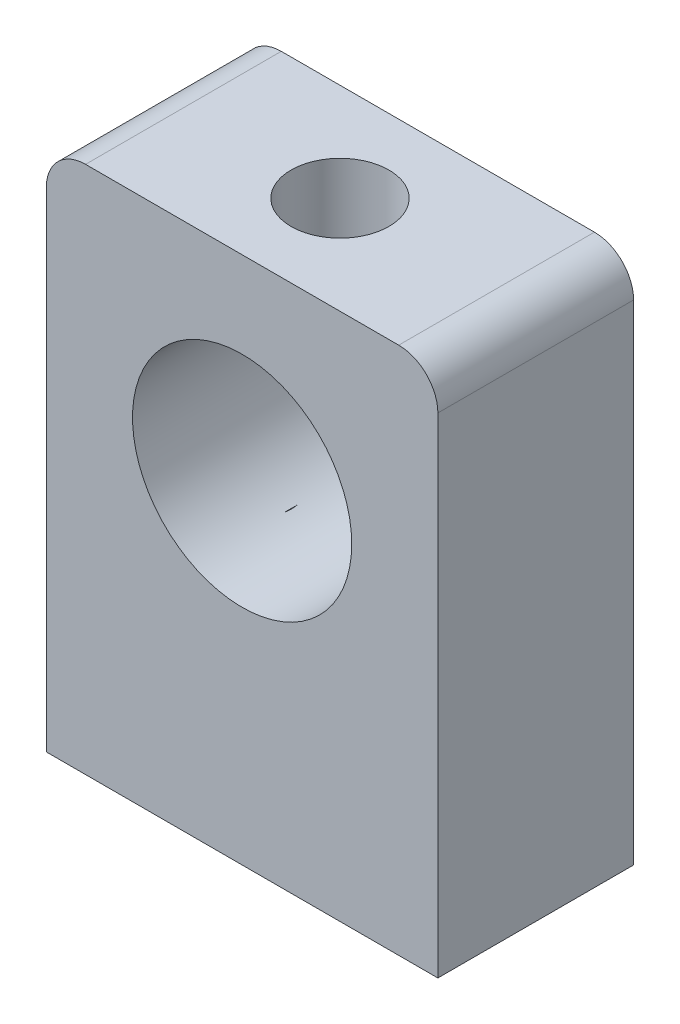
ISO-10303-21;
HEADER;
FILE_DESCRIPTION(('STEP AP214'),'2;1');
FILE_NAME('part.step','',(''),(''),'','','');
FILE_SCHEMA(('AUTOMOTIVE_DESIGN { 1 0 10303 214 1 1 1 1 }'));
ENDSEC;
DATA;
#1=APPLICATION_CONTEXT('core data for automotive mechanical design processes');
#2=APPLICATION_PROTOCOL_DEFINITION('international standard','automotive_design',2000,#1);
#3=PRODUCT_CONTEXT('',#1,'mechanical');
#4=PRODUCT('Part','Part','',(#3));
#5=PRODUCT_RELATED_PRODUCT_CATEGORY('part','',(#4));
#6=PRODUCT_DEFINITION_FORMATION('','',#4);
#7=PRODUCT_DEFINITION_CONTEXT('part definition',#1,'design');
#8=PRODUCT_DEFINITION('design','',#6,#7);
#9=PRODUCT_DEFINITION_SHAPE('','',#8);
#10=(LENGTH_UNIT() NAMED_UNIT(*) SI_UNIT(.MILLI.,.METRE.));
#11=(NAMED_UNIT(*) PLANE_ANGLE_UNIT() SI_UNIT($,.RADIAN.));
#12=(NAMED_UNIT(*) SI_UNIT($,.STERADIAN.) SOLID_ANGLE_UNIT());
#13=UNCERTAINTY_MEASURE_WITH_UNIT(LENGTH_MEASURE(1.E-05),#10,'distance_accuracy_value','');
#14=(GEOMETRIC_REPRESENTATION_CONTEXT(3) GLOBAL_UNCERTAINTY_ASSIGNED_CONTEXT((#13)) GLOBAL_UNIT_ASSIGNED_CONTEXT((#10,
#11,#12)) REPRESENTATION_CONTEXT('',''));
#15=CARTESIAN_POINT('',(0.,0.,0.));
#16=DIRECTION('',(0.,0.,1.));
#17=DIRECTION('',(1.,0.,0.));
#18=AXIS2_PLACEMENT_3D('',#15,#16,#17);
#19=CARTESIAN_POINT('',(-9.06164383561643,7.77739726027397,10.));
#20=DIRECTION('',(0.,0.,1.));
#21=DIRECTION('',(1.,0.,0.));
#22=AXIS2_PLACEMENT_3D('',#19,#20,#21);
#23=PLANE('',#22);
#24=DIRECTION('',(0.,1.,0.));
#25=VECTOR('',#24,1.);
#26=CARTESIAN_POINT('',(8.93835616438356,7.77739726027396,10.));
#27=LINE('',#26,#25);
#28=CARTESIAN_POINT('',(8.93835616438357,-17.222602739726,10.));
#29=VERTEX_POINT('',#28);
#30=CARTESIAN_POINT('',(8.93835616438356,7.77739726027396,10.));
#31=VERTEX_POINT('',#30);
#32=EDGE_CURVE('E173',#29,#31,#27,.T.);
#33=ORIENTED_EDGE('',*,*,#32,.T.);
#34=CARTESIAN_POINT('',(6.93835616438356,7.77739726027397,10.));
#35=DIRECTION('',(0.,0.,1.));
#36=DIRECTION('',(-1.,0.,0.));
#37=AXIS2_PLACEMENT_3D('',#34,#35,#36);
#38=CIRCLE('',#37,2.);
#39=CARTESIAN_POINT('',(6.93835616438355,9.77739726027397,10.));
#40=VERTEX_POINT('',#39);
#41=EDGE_CURVE('E193',#31,#40,#38,.T.);
#42=ORIENTED_EDGE('',*,*,#41,.T.);
#43=DIRECTION('',(-1.,0.,0.));
#44=VECTOR('',#43,1.);
#45=CARTESIAN_POINT('',(-9.06164383561642,9.77739726027397,10.));
#46=LINE('',#45,#44);
#47=CARTESIAN_POINT('',(-9.06164383561642,9.77739726027397,10.));
#48=VERTEX_POINT('',#47);
#49=EDGE_CURVE('E191',#40,#48,#46,.T.);
#50=ORIENTED_EDGE('',*,*,#49,.T.);
#51=CARTESIAN_POINT('',(-9.06164383561643,7.77739726027397,10.));
#52=DIRECTION('',(0.,0.,1.));
#53=DIRECTION('',(1.,0.,0.));
#54=AXIS2_PLACEMENT_3D('',#51,#52,#53);
#55=CIRCLE('',#54,2.);
#56=CARTESIAN_POINT('',(-11.0616438356164,7.77739726027396,10.));
#57=VERTEX_POINT('',#56);
#58=EDGE_CURVE('E189',#48,#57,#55,.T.);
#59=ORIENTED_EDGE('',*,*,#58,.T.);
#60=DIRECTION('',(0.,-1.,0.));
#61=VECTOR('',#60,1.);
#62=CARTESIAN_POINT('',(-11.0616438356164,7.77739726027396,10.));
#63=LINE('',#62,#61);
#64=CARTESIAN_POINT('',(-11.0616438356164,-17.222602739726,10.));
#65=VERTEX_POINT('',#64);
#66=EDGE_CURVE('E187',#57,#65,#63,.T.);
#67=ORIENTED_EDGE('',*,*,#66,.T.);
#68=DIRECTION('',(1.,0.,0.));
#69=VECTOR('',#68,1.);
#70=CARTESIAN_POINT('',(-11.0616438356164,-17.222602739726,10.));
#71=LINE('',#70,#69);
#72=EDGE_CURVE('E170',#65,#29,#71,.T.);
#73=ORIENTED_EDGE('',*,*,#72,.T.);
#74=EDGE_LOOP('',(#33,#42,#50,#59,#67,#73));
#75=FACE_BOUND('',#74,.T.);
#76=CARTESIAN_POINT('',(-1.06164383561643,-0.222602739726027,10.));
#77=DIRECTION('',(0.,0.,1.));
#78=DIRECTION('',(1.,0.,0.));
#79=AXIS2_PLACEMENT_3D('',#76,#77,#78);
#80=CIRCLE('',#79,5.6);
#81=CARTESIAN_POINT('',(4.53835616438357,-0.222602739726027,10.));
#82=VERTEX_POINT('',#81);
#83=EDGE_CURVE('E185',#82,#82,#80,.T.);
#84=ORIENTED_EDGE('',*,*,#83,.F.);
#85=EDGE_LOOP('',(#84));
#86=FACE_BOUND('',#85,.T.);
#87=ADVANCED_FACE('F41',(#75,#86),#23,.T.);
#88=CARTESIAN_POINT('',(-9.06164383561643,7.77739726027397,0.));
#89=DIRECTION('',(0.,0.,1.));
#90=DIRECTION('',(1.,0.,0.));
#91=AXIS2_PLACEMENT_3D('',#88,#89,#90);
#92=PLANE('',#91);
#93=DIRECTION('',(0.,1.,0.));
#94=VECTOR('',#93,1.);
#95=CARTESIAN_POINT('',(8.93835616438356,7.77739726027396,0.));
#96=LINE('',#95,#94);
#97=CARTESIAN_POINT('',(8.93835616438357,-17.222602739726,0.));
#98=VERTEX_POINT('',#97);
#99=CARTESIAN_POINT('',(8.93835616438356,7.77739726027396,0.));
#100=VERTEX_POINT('',#99);
#101=EDGE_CURVE('E182',#98,#100,#96,.T.);
#102=ORIENTED_EDGE('',*,*,#101,.F.);
#103=DIRECTION('',(1.,0.,0.));
#104=VECTOR('',#103,1.);
#105=CARTESIAN_POINT('',(-11.0616438356164,-17.222602739726,0.));
#106=LINE('',#105,#104);
#107=CARTESIAN_POINT('',(-11.0616438356164,-17.222602739726,0.));
#108=VERTEX_POINT('',#107);
#109=EDGE_CURVE('E171',#108,#98,#106,.T.);
#110=ORIENTED_EDGE('',*,*,#109,.F.);
#111=DIRECTION('',(0.,-1.,0.));
#112=VECTOR('',#111,1.);
#113=CARTESIAN_POINT('',(-11.0616438356164,7.77739726027396,0.));
#114=LINE('',#113,#112);
#115=CARTESIAN_POINT('',(-11.0616438356164,7.77739726027396,0.));
#116=VERTEX_POINT('',#115);
#117=EDGE_CURVE('E174',#116,#108,#114,.T.);
#118=ORIENTED_EDGE('',*,*,#117,.F.);
#119=CARTESIAN_POINT('',(-9.06164383561643,7.77739726027397,0.));
#120=DIRECTION('',(0.,0.,1.));
#121=DIRECTION('',(1.,0.,0.));
#122=AXIS2_PLACEMENT_3D('',#119,#120,#121);
#123=CIRCLE('',#122,2.);
#124=CARTESIAN_POINT('',(-9.06164383561642,9.77739726027397,0.));
#125=VERTEX_POINT('',#124);
#126=EDGE_CURVE('E176',#125,#116,#123,.T.);
#127=ORIENTED_EDGE('',*,*,#126,.F.);
#128=DIRECTION('',(-1.,0.,0.));
#129=VECTOR('',#128,1.);
#130=CARTESIAN_POINT('',(-9.06164383561642,9.77739726027397,0.));
#131=LINE('',#130,#129);
#132=CARTESIAN_POINT('',(6.93835616438355,9.77739726027397,0.));
#133=VERTEX_POINT('',#132);
#134=EDGE_CURVE('E178',#133,#125,#131,.T.);
#135=ORIENTED_EDGE('',*,*,#134,.F.);
#136=CARTESIAN_POINT('',(6.93835616438356,7.77739726027397,0.));
#137=DIRECTION('',(0.,0.,1.));
#138=DIRECTION('',(-1.,0.,0.));
#139=AXIS2_PLACEMENT_3D('',#136,#137,#138);
#140=CIRCLE('',#139,2.);
#141=EDGE_CURVE('E180',#100,#133,#140,.T.);
#142=ORIENTED_EDGE('',*,*,#141,.F.);
#143=EDGE_LOOP('',(#102,#110,#118,#127,#135,#142));
#144=FACE_BOUND('',#143,.T.);
#145=CARTESIAN_POINT('',(-1.06164383561643,-0.222602739726027,0.));
#146=DIRECTION('',(0.,0.,1.));
#147=DIRECTION('',(1.,0.,0.));
#148=AXIS2_PLACEMENT_3D('',#145,#146,#147);
#149=CIRCLE('',#148,5.6);
#150=CARTESIAN_POINT('',(4.53835616438357,-0.222602739726027,0.));
#151=VERTEX_POINT('',#150);
#152=EDGE_CURVE('E151',#151,#151,#149,.T.);
#153=ORIENTED_EDGE('',*,*,#152,.T.);
#154=EDGE_LOOP('',(#153));
#155=FACE_BOUND('',#154,.T.);
#156=ADVANCED_FACE('F228',(#144,#155),#92,.F.);
#157=CARTESIAN_POINT('',(8.93835616438356,7.77739726027396,10.));
#158=DIRECTION('',(-1.,0.,0.));
#159=DIRECTION('',(0.,-1.,0.));
#160=AXIS2_PLACEMENT_3D('',#157,#158,#159);
#161=PLANE('',#160);
#162=ORIENTED_EDGE('',*,*,#101,.T.);
#163=DIRECTION('',(0.,0.,-1.));
#164=VECTOR('',#163,1.);
#165=CARTESIAN_POINT('',(8.93835616438356,7.77739726027396,10.));
#166=LINE('',#165,#164);
#167=EDGE_CURVE('E114',#31,#100,#166,.T.);
#168=ORIENTED_EDGE('',*,*,#167,.F.);
#169=ORIENTED_EDGE('',*,*,#32,.F.);
#170=DIRECTION('',(0.,0.,-1.));
#171=VECTOR('',#170,1.);
#172=CARTESIAN_POINT('',(8.93835616438357,-17.222602739726,10.));
#173=LINE('',#172,#171);
#174=EDGE_CURVE('E167',#29,#98,#173,.T.);
#175=ORIENTED_EDGE('',*,*,#174,.T.);
#176=EDGE_LOOP('',(#162,#168,#169,#175));
#177=FACE_BOUND('',#176,.T.);
#178=ADVANCED_FACE('F43',(#177),#161,.F.);
#179=CARTESIAN_POINT('',(6.93835616438356,7.77739726027397,10.));
#180=DIRECTION('',(0.,0.,-1.));
#181=DIRECTION('',(-1.,0.,0.));
#182=AXIS2_PLACEMENT_3D('',#179,#180,#181);
#183=CYLINDRICAL_SURFACE('',#182,2.);
#184=ORIENTED_EDGE('',*,*,#141,.T.);
#185=DIRECTION('',(0.,0.,-1.));
#186=VECTOR('',#185,1.);
#187=CARTESIAN_POINT('',(6.93835616438355,9.77739726027397,10.));
#188=LINE('',#187,#186);
#189=EDGE_CURVE('E155',#40,#133,#188,.T.);
#190=ORIENTED_EDGE('',*,*,#189,.F.);
#191=ORIENTED_EDGE('',*,*,#41,.F.);
#192=ORIENTED_EDGE('',*,*,#167,.T.);
#193=EDGE_LOOP('',(#184,#190,#191,#192));
#194=FACE_BOUND('',#193,.T.);
#195=ADVANCED_FACE('F234',(#194),#183,.T.);
#196=CARTESIAN_POINT('',(-9.06164383561642,9.77739726027397,10.));
#197=DIRECTION('',(0.,-1.,0.));
#198=DIRECTION('',(0.,0.,-1.));
#199=AXIS2_PLACEMENT_3D('',#196,#197,#198);
#200=PLANE('',#199);
#201=CARTESIAN_POINT('',(-1.06164383561644,9.77739726027397,5.));
#202=DIRECTION('',(0.,1.,0.));
#203=DIRECTION('',(0.,0.,1.));
#204=AXIS2_PLACEMENT_3D('',#201,#202,#203);
#205=CIRCLE('',#204,2.5);
#206=CARTESIAN_POINT('',(-1.06164383561644,9.77739726027397,7.5));
#207=VERTEX_POINT('',#206);
#208=EDGE_CURVE('E152',#207,#207,#205,.T.);
#209=ORIENTED_EDGE('',*,*,#208,.F.);
#210=EDGE_LOOP('',(#209));
#211=FACE_BOUND('',#210,.T.);
#212=ORIENTED_EDGE('',*,*,#134,.T.);
#213=DIRECTION('',(0.,0.,-1.));
#214=VECTOR('',#213,1.);
#215=CARTESIAN_POINT('',(-9.06164383561642,9.77739726027397,10.));
#216=LINE('',#215,#214);
#217=EDGE_CURVE('E158',#48,#125,#216,.T.);
#218=ORIENTED_EDGE('',*,*,#217,.F.);
#219=ORIENTED_EDGE('',*,*,#49,.F.);
#220=ORIENTED_EDGE('',*,*,#189,.T.);
#221=EDGE_LOOP('',(#212,#218,#219,#220));
#222=FACE_BOUND('',#221,.T.);
#223=ADVANCED_FACE('F246',(#211,#222),#200,.F.);
#224=CARTESIAN_POINT('',(-9.06164383561643,7.77739726027397,10.));
#225=DIRECTION('',(0.,0.,-1.));
#226=DIRECTION('',(-1.,0.,0.));
#227=AXIS2_PLACEMENT_3D('',#224,#225,#226);
#228=CYLINDRICAL_SURFACE('',#227,2.);
#229=ORIENTED_EDGE('',*,*,#126,.T.);
#230=DIRECTION('',(0.,0.,-1.));
#231=VECTOR('',#230,1.);
#232=CARTESIAN_POINT('',(-11.0616438356164,7.77739726027396,10.));
#233=LINE('',#232,#231);
#234=EDGE_CURVE('E161',#57,#116,#233,.T.);
#235=ORIENTED_EDGE('',*,*,#234,.F.);
#236=ORIENTED_EDGE('',*,*,#58,.F.);
#237=ORIENTED_EDGE('',*,*,#217,.T.);
#238=EDGE_LOOP('',(#229,#235,#236,#237));
#239=FACE_BOUND('',#238,.T.);
#240=ADVANCED_FACE('F243',(#239),#228,.T.);
#241=CARTESIAN_POINT('',(-11.0616438356164,7.77739726027396,10.));
#242=DIRECTION('',(1.,0.,0.));
#243=DIRECTION('',(0.,1.,0.));
#244=AXIS2_PLACEMENT_3D('',#241,#242,#243);
#245=PLANE('',#244);
#246=ORIENTED_EDGE('',*,*,#117,.T.);
#247=DIRECTION('',(0.,0.,-1.));
#248=VECTOR('',#247,1.);
#249=CARTESIAN_POINT('',(-11.0616438356164,-17.222602739726,10.));
#250=LINE('',#249,#248);
#251=EDGE_CURVE('E164',#65,#108,#250,.T.);
#252=ORIENTED_EDGE('',*,*,#251,.F.);
#253=ORIENTED_EDGE('',*,*,#66,.F.);
#254=ORIENTED_EDGE('',*,*,#234,.T.);
#255=EDGE_LOOP('',(#246,#252,#253,#254));
#256=FACE_BOUND('',#255,.T.);
#257=ADVANCED_FACE('F214',(#256),#245,.F.);
#258=CARTESIAN_POINT('',(-11.0616438356164,-17.222602739726,10.));
#259=DIRECTION('',(0.,1.,0.));
#260=DIRECTION('',(0.,0.,1.));
#261=AXIS2_PLACEMENT_3D('',#258,#259,#260);
#262=PLANE('',#261);
#263=CARTESIAN_POINT('',(-6.06164383561643,-17.222602739726,5.));
#264=DIRECTION('',(0.,-1.,0.));
#265=DIRECTION('',(0.,0.,-1.));
#266=AXIS2_PLACEMENT_3D('',#263,#264,#265);
#267=CIRCLE('',#266,2.5);
#268=CARTESIAN_POINT('',(-6.06164383561643,-17.222602739726,2.5));
#269=VERTEX_POINT('',#268);
#270=EDGE_CURVE('E205',#269,#269,#267,.T.);
#271=ORIENTED_EDGE('',*,*,#270,.F.);
#272=EDGE_LOOP('',(#271));
#273=FACE_BOUND('',#272,.T.);
#274=CARTESIAN_POINT('',(3.93835616438357,-17.222602739726,5.));
#275=DIRECTION('',(0.,-1.,0.));
#276=DIRECTION('',(0.,0.,-1.));
#277=AXIS2_PLACEMENT_3D('',#274,#275,#276);
#278=CIRCLE('',#277,2.5);
#279=CARTESIAN_POINT('',(3.93835616438357,-17.222602739726,2.5));
#280=VERTEX_POINT('',#279);
#281=EDGE_CURVE('E119',#280,#280,#278,.T.);
#282=ORIENTED_EDGE('',*,*,#281,.F.);
#283=EDGE_LOOP('',(#282));
#284=FACE_BOUND('',#283,.T.);
#285=ORIENTED_EDGE('',*,*,#109,.T.);
#286=ORIENTED_EDGE('',*,*,#174,.F.);
#287=ORIENTED_EDGE('',*,*,#72,.F.);
#288=ORIENTED_EDGE('',*,*,#251,.T.);
#289=EDGE_LOOP('',(#285,#286,#287,#288));
#290=FACE_BOUND('',#289,.T.);
#291=ADVANCED_FACE('F211',(#273,#284,#290),#262,.F.);
#292=CARTESIAN_POINT('',(-1.06164383561643,-0.222602739726027,10.));
#293=DIRECTION('',(0.,0.,-1.));
#294=DIRECTION('',(-1.,0.,0.));
#295=AXIS2_PLACEMENT_3D('',#292,#293,#294);
#296=CYLINDRICAL_SURFACE('',#295,5.6);
#297=CARTESIAN_POINT('',(-3.58354787820013,-5.22260273972603,5.33021269787367));
#298=CARTESIAN_POINT('',(-3.56894518314433,-5.22992802413852,5.22014179858244));
#299=CARTESIAN_POINT('',(-3.56164383561643,-5.23359066634476,5.11007089929122));
#300=CARTESIAN_POINT('',(-3.56164383561643,-5.23359066634476,4.88992910070878));
#301=CARTESIAN_POINT('',(-3.56894518314433,-5.22992802413852,4.77985820141756));
#302=CARTESIAN_POINT('',(-3.58354787820013,-5.22260273972603,4.66978730212633));
#303=B_SPLINE_CURVE_WITH_KNOTS('',3,(#297,#298,#299,#300,#301,#302),.UNSPECIFIED.,.F.,.F.,(4,2,
4),(0.,0.331120744517604,0.662241489035208),.UNSPECIFIED.);
#304=CARTESIAN_POINT('',(-3.58354787820013,-5.22260273972603,5.33021269787366));
#305=VERTEX_POINT('',#304);
#306=CARTESIAN_POINT('',(-3.58354787820013,-5.22260273972603,4.66978730212634));
#307=VERTEX_POINT('',#306);
#308=EDGE_CURVE('E11',#305,#307,#303,.T.);
#309=ORIENTED_EDGE('',*,*,#308,.F.);
#310=DIRECTION('',(0.,0.,-1.));
#311=VECTOR('',#310,1.);
#312=CARTESIAN_POINT('',(-3.58354787820013,-5.22260273972603,10.));
#313=LINE('',#312,#311);
#314=EDGE_CURVE('E55',#305,#307,#313,.T.);
#315=ORIENTED_EDGE('',*,*,#314,.T.);
#316=EDGE_LOOP('',(#309,#315));
#317=FACE_BOUND('',#316,.T.);
#318=CARTESIAN_POINT('',(1.46026020696726,-5.22260273972603,4.66978730212639));
#319=CARTESIAN_POINT('',(1.44565751191147,-5.22992802413851,4.77985820141759));
#320=CARTESIAN_POINT('',(1.43835616438357,-5.23359066634476,4.8899291007088));
#321=CARTESIAN_POINT('',(1.43835616438357,-5.23359066634476,5.1100708992912));
#322=CARTESIAN_POINT('',(1.44565751191147,-5.22992802413852,5.22014179858241));
#323=CARTESIAN_POINT('',(1.46026020696726,-5.22260273972603,5.33021269787361));
#324=B_SPLINE_CURVE_WITH_KNOTS('',3,(#318,#319,#320,#321,#322,#323),.UNSPECIFIED.,.F.,.F.,(4,2,
4),(0.,0.331120744517549,0.662241489035097),.UNSPECIFIED.);
#325=CARTESIAN_POINT('',(1.46026020696726,-5.22260273972603,4.66978730212639));
#326=VERTEX_POINT('',#325);
#327=CARTESIAN_POINT('',(1.46026020696726,-5.22260273972603,5.33021269787361));
#328=VERTEX_POINT('',#327);
#329=EDGE_CURVE('E113',#326,#328,#324,.T.);
#330=ORIENTED_EDGE('',*,*,#329,.F.);
#331=DIRECTION('',(0.,0.,-1.));
#332=VECTOR('',#331,1.);
#333=CARTESIAN_POINT('',(1.46026020696726,-5.22260273972603,10.));
#334=LINE('',#333,#332);
#335=EDGE_CURVE('E109',#326,#328,#334,.F.);
#336=ORIENTED_EDGE('',*,*,#335,.T.);
#337=EDGE_LOOP('',(#330,#336));
#338=FACE_BOUND('',#337,.T.);
#339=CARTESIAN_POINT('',(-1.06164383561644,5.37739726027397,7.5));
#340=CARTESIAN_POINT('',(-1.19469841465232,5.37739138665617,7.49999275560594));
#341=CARTESIAN_POINT('',(-1.32796330813381,5.37260197484055,7.48931472153596));
#342=CARTESIAN_POINT('',(-1.59065361230423,5.35391809551393,7.44702518683565));
#343=CARTESIAN_POINT('',(-1.7200690863105,5.34000189611074,7.41536372042958));
#344=CARTESIAN_POINT('',(-1.97084799879824,5.30454186528798,7.33253458131731));
#345=CARTESIAN_POINT('',(-2.09223845960188,5.28302536161131,7.28143674432088));
#346=CARTESIAN_POINT('',(-2.32458886016903,5.23441828549549,7.16149875751637));
#347=CARTESIAN_POINT('',(-2.43555111384956,5.20732895388675,7.09266255642277));
#348=CARTESIAN_POINT('',(-2.65029232000024,5.14854395935625,6.93515414960602));
#349=CARTESIAN_POINT('',(-2.75341363781619,5.11668356733782,6.84564750190917));
#350=CARTESIAN_POINT('',(-2.94376226672882,5.05259741839284,6.6511114135733));
#351=CARTESIAN_POINT('',(-3.03098001892394,5.02037145401583,6.54607270555719));
#352=CARTESIAN_POINT('',(-3.19210509343002,4.95707561591699,6.31604595259586));
#353=CARTESIAN_POINT('',(-3.26493804603802,4.92618307837291,6.19025124477651));
#354=CARTESIAN_POINT('',(-3.38811869367454,4.87171605677798,5.92663142122819));
#355=CARTESIAN_POINT('',(-3.43847962580349,4.8481372670803,5.78881344513661));
#356=CARTESIAN_POINT('',(-3.51247251864909,4.81277710436319,5.51261540735463));
#357=CARTESIAN_POINT('',(-3.53737782423096,4.80043749514471,5.37465097257931));
#358=CARTESIAN_POINT('',(-3.56371001451318,4.7873777798769,5.09599276993942));
#359=CARTESIAN_POINT('',(-3.56515279649003,4.78664980624972,4.95530091478304));
#360=CARTESIAN_POINT('',(-3.54546804778346,4.79643047819846,4.68880178856112));
#361=CARTESIAN_POINT('',(-3.52637079382599,4.80592843077615,4.56279951763985));
#362=CARTESIAN_POINT('',(-3.46959159892078,4.83336117369884,4.31602205706248));
#363=CARTESIAN_POINT('',(-3.43190543219996,4.85129788236326,4.19524806273181));
#364=CARTESIAN_POINT('',(-3.33827157695083,4.89400300263946,3.95910084844413));
#365=CARTESIAN_POINT('',(-3.28193184770725,4.91891613260724,3.84391044155132));
#366=CARTESIAN_POINT('',(-3.15287256968498,4.97274557974971,3.6241291796112));
#367=CARTESIAN_POINT('',(-3.08014609759427,5.00166358696796,3.51954283188268));
#368=CARTESIAN_POINT('',(-2.91199754920904,5.06369805095299,3.31310681826863));
#369=CARTESIAN_POINT('',(-2.81504656474889,5.09694766344109,3.21253865811298));
#370=CARTESIAN_POINT('',(-2.60538065053152,5.16153177524397,3.02862231505001));
#371=CARTESIAN_POINT('',(-2.49266088854225,5.1928656832587,2.94527943017718));
#372=CARTESIAN_POINT('',(-2.25026899144383,5.25125787470998,2.79590717529721));
#373=CARTESIAN_POINT('',(-2.12018924420639,5.27815939340913,2.73047329037965));
#374=CARTESIAN_POINT('',(-1.84935874079792,5.32341397541545,2.62288029570743));
#375=CARTESIAN_POINT('',(-1.7086148376783,5.34177247540137,2.58070638040199));
#376=CARTESIAN_POINT('',(-1.43109431352454,5.3668101581047,2.52368400589982));
#377=CARTESIAN_POINT('',(-1.29473627201558,5.37422076461718,2.50712041426818));
#378=CARTESIAN_POINT('',(-1.0209956413158,5.37892029592838,2.49658443583328));
#379=CARTESIAN_POINT('',(-0.883613420513853,5.37621269997554,2.5026042834839));
#380=CARTESIAN_POINT('',(-0.620250518057279,5.361442543656,2.53590637489461));
#381=CARTESIAN_POINT('',(-0.494074120097992,5.34993881204983,2.56191894944644));
#382=CARTESIAN_POINT('',(-0.248053578500273,5.31936861432399,2.63262611561232));
#383=CARTESIAN_POINT('',(-0.128210203977604,5.30030123201575,2.67732297049738));
#384=CARTESIAN_POINT('',(0.105988144635167,5.25565401705564,2.78554804916581));
#385=CARTESIAN_POINT('',(0.220055565589229,5.22988969869235,2.84961987462096));
#386=CARTESIAN_POINT('',(0.436230870489043,5.17451162577642,2.99418381192107));
#387=CARTESIAN_POINT('',(0.538333506250888,5.14489619391406,3.07468308730793));
#388=CARTESIAN_POINT('',(0.736428662312506,5.08197981436474,3.25743366808804));
#389=CARTESIAN_POINT('',(0.831250810797114,5.04857492108211,3.36092086214154));
#390=CARTESIAN_POINT('',(1.00258087711808,4.98387231427276,3.58274041608678));
#391=CARTESIAN_POINT('',(1.07908211471612,4.9525753723356,3.70107816694754));
#392=CARTESIAN_POINT('',(1.2131871879157,4.89507398179777,3.95310266933426));
#393=CARTESIAN_POINT('',(1.27028826377074,4.86901128751868,4.08709183588443));
#394=CARTESIAN_POINT('',(1.36056959711645,4.82669542909978,4.36432805654078));
#395=CARTESIAN_POINT('',(1.39377353794439,4.81043255542342,4.50756579093762));
#396=CARTESIAN_POINT('',(1.43280988478874,4.79119132930907,4.78608332172926));
#397=CARTESIAN_POINT('',(1.44073497668636,4.78719838484364,4.92100010754536));
#398=CARTESIAN_POINT('',(1.43474048180261,4.79018897244579,5.190207706851));
#399=CARTESIAN_POINT('',(1.42082566681972,4.79717010678878,5.32449865065129));
#400=CARTESIAN_POINT('',(1.37338349320596,4.82033934034678,5.58009478211212));
#401=CARTESIAN_POINT('',(1.34110917539965,4.83593752566342,5.70169161626887));
#402=CARTESIAN_POINT('',(1.25919398892371,4.87403742730168,5.93772584864248));
#403=CARTESIAN_POINT('',(1.20954808813046,4.89654114375449,6.05216116100587));
#404=CARTESIAN_POINT('',(1.09064774153805,4.94770467633921,6.27868797183286));
#405=CARTESIAN_POINT('',(1.02033755011452,4.97666733186677,6.39015540346868));
#406=CARTESIAN_POINT('',(0.863471371297429,5.03676844341212,6.60035908584463));
#407=CARTESIAN_POINT('',(0.776908521626077,5.06790781499491,6.69908992906323));
#408=CARTESIAN_POINT('',(0.580919718602705,5.13216284914222,6.8900553614405));
#409=CARTESIAN_POINT('',(0.470147730560468,5.16520922538491,6.98093973627804));
#410=CARTESIAN_POINT('',(0.233810492001908,5.22686727349789,7.14297596001292));
#411=CARTESIAN_POINT('',(0.108238506219437,5.25547691245091,7.21411877502435));
#412=CARTESIAN_POINT('',(-0.153268945611973,5.30480945442292,7.33350155443951));
#413=CARTESIAN_POINT('',(-0.289077277001669,5.32561450958969,7.38198148992158));
#414=CARTESIAN_POINT('',(-0.497984114491996,5.34940199543697,7.43669560389835));
#415=CARTESIAN_POINT('',(-0.568426028869692,5.35609204010531,7.45192758496574));
#416=CARTESIAN_POINT('',(-0.710542969922224,5.36683240475112,7.47626944823147));
#417=CARTESIAN_POINT('',(-0.78221710812499,5.37088455103387,7.48538356616743));
#418=CARTESIAN_POINT('',(-0.888664616864229,5.3748316802433,7.49424887555825));
#419=CARTESIAN_POINT('',(-0.923217006504125,5.37579264197201,7.49640423789967));
#420=CARTESIAN_POINT('',(-0.992389458663053,5.37707620038466,7.49928075183916));
#421=CARTESIAN_POINT('',(-1.02700952201245,5.37739878918581,7.50000188572703));
#422=CARTESIAN_POINT('',(-1.06164383561644,5.37739726027397,7.5));
#423=B_SPLINE_CURVE_WITH_KNOTS('',3,(#339,#340,#341,#342,#343,#344,#345,#346,#347,#348,#349,
#350,#351,#352,#353,#354,#355,#356,#357,#358,#359,#360,#361,#362,#363,#364,#365,#366,#367,#368,
#369,#370,#371,#372,#373,#374,#375,#376,#377,#378,#379,#380,#381,#382,#383,#384,#385,#386,#387,
#388,#389,#390,#391,#392,#393,#394,#395,#396,#397,#398,#399,#400,#401,#402,#403,#404,#405,#406,
#407,#408,#409,#410,#411,#412,#413,#414,#415,#416,#417,#418,#419,#420,#421,#422),.UNSPECIFIED.,
.T.,.F.,(4,2,2,2,2,2,2,2,2,2,2,2,2,2,2,2,2,2,2,2,2,2,2,2,2,2,2,2,2,2,2,2,2,2,2,2,2,2,2,2,2,4),
(0.,0.399028315855024,0.799010228836765,1.19756836127053,1.59603784771882,2.01488680723896,
2.43398669367272,2.87755450797324,3.32086069347207,3.74070950176348,4.16027382527353,
4.54187735373633,4.92356767122488,5.31385143790915,5.70430040763814,6.1331620650785,
6.56215543325083,7.00403918990233,7.44564135094343,7.85614561385944,8.26650873363461,
8.65276814635421,9.03907436115336,9.43742304026452,9.83594580048667,10.2668465688524,
10.6979042154477,11.1394056710944,11.5804689704311,11.9839199565518,12.3872828049878,
12.7659478112198,13.1447225983948,13.5478576647006,13.9511633290334,14.3901953698439,
14.829427984941,15.2638980053959,15.4807803682518,15.697512416051,15.8013788239413,
15.9052465143909),.UNSPECIFIED.);
#424=CARTESIAN_POINT('',(-1.06164383561644,5.37739726027397,7.5));
#425=VERTEX_POINT('',#424);
#426=EDGE_CURVE('E145',#425,#425,#423,.T.);
#427=ORIENTED_EDGE('',*,*,#426,.F.);
#428=EDGE_LOOP('',(#427));
#429=FACE_BOUND('',#428,.T.);
#430=ORIENTED_EDGE('',*,*,#83,.T.);
#431=EDGE_LOOP('',(#430));
#432=FACE_BOUND('',#431,.T.);
#433=ORIENTED_EDGE('',*,*,#152,.F.);
#434=EDGE_LOOP('',(#433));
#435=FACE_BOUND('',#434,.T.);
#436=ADVANCED_FACE('F121',(#317,#338,#429,#432,#435),#296,.F.);
#437=CARTESIAN_POINT('',(-1.06164383561644,3.77739726027397,5.));
#438=DIRECTION('',(0.,1.,0.));
#439=DIRECTION('',(0.,0.,1.));
#440=AXIS2_PLACEMENT_3D('',#437,#438,#439);
#441=CYLINDRICAL_SURFACE('',#440,2.5);
#442=ORIENTED_EDGE('',*,*,#426,.T.);
#443=EDGE_LOOP('',(#442));
#444=FACE_BOUND('',#443,.T.);
#445=ORIENTED_EDGE('',*,*,#208,.T.);
#446=EDGE_LOOP('',(#445));
#447=FACE_BOUND('',#446,.T.);
#448=ADVANCED_FACE('F137',(#444,#447),#441,.F.);
#449=CARTESIAN_POINT('',(3.93835616438357,-5.22260273972603,5.));
#450=DIRECTION('',(0.,-1.,0.));
#451=DIRECTION('',(0.,0.,-1.));
#452=AXIS2_PLACEMENT_3D('',#449,#450,#451);
#453=CYLINDRICAL_SURFACE('',#452,2.5);
#454=ORIENTED_EDGE('',*,*,#329,.T.);
#455=CARTESIAN_POINT('',(3.93835616438357,-5.22260273972603,5.));
#456=DIRECTION('',(0.,-1.,0.));
#457=DIRECTION('',(0.,0.,-1.));
#458=AXIS2_PLACEMENT_3D('',#455,#456,#457);
#459=CIRCLE('',#458,2.5);
#460=EDGE_CURVE('E67',#326,#328,#459,.T.);
#461=ORIENTED_EDGE('',*,*,#460,.F.);
#462=EDGE_LOOP('',(#454,#461));
#463=FACE_BOUND('',#462,.T.);
#464=ORIENTED_EDGE('',*,*,#281,.T.);
#465=EDGE_LOOP('',(#464));
#466=FACE_BOUND('',#465,.T.);
#467=ADVANCED_FACE('F117',(#463,#466),#453,.F.);
#468=CARTESIAN_POINT('',(3.93835616438357,-5.22260273972603,5.));
#469=DIRECTION('',(0.,-1.,0.));
#470=DIRECTION('',(0.,0.,-1.));
#471=AXIS2_PLACEMENT_3D('',#468,#469,#470);
#472=PLANE('',#471);
#473=ORIENTED_EDGE('',*,*,#460,.T.);
#474=ORIENTED_EDGE('',*,*,#335,.F.);
#475=EDGE_LOOP('',(#473,#474));
#476=FACE_BOUND('',#475,.T.);
#477=ADVANCED_FACE('F110',(#476),#472,.T.);
#478=CARTESIAN_POINT('',(-6.06164383561643,-5.22260273972603,5.));
#479=DIRECTION('',(0.,-1.,0.));
#480=DIRECTION('',(0.,0.,-1.));
#481=AXIS2_PLACEMENT_3D('',#478,#479,#480);
#482=CYLINDRICAL_SURFACE('',#481,2.5);
#483=ORIENTED_EDGE('',*,*,#308,.T.);
#484=CARTESIAN_POINT('',(-6.06164383561643,-5.22260273972603,5.));
#485=DIRECTION('',(0.,-1.,0.));
#486=DIRECTION('',(0.,0.,-1.));
#487=AXIS2_PLACEMENT_3D('',#484,#485,#486);
#488=CIRCLE('',#487,2.5);
#489=EDGE_CURVE('E61',#305,#307,#488,.T.);
#490=ORIENTED_EDGE('',*,*,#489,.F.);
#491=EDGE_LOOP('',(#483,#490));
#492=FACE_BOUND('',#491,.T.);
#493=ORIENTED_EDGE('',*,*,#270,.T.);
#494=EDGE_LOOP('',(#493));
#495=FACE_BOUND('',#494,.T.);
#496=ADVANCED_FACE('F138',(#492,#495),#482,.F.);
#497=CARTESIAN_POINT('',(-6.06164383561643,-5.22260273972603,5.));
#498=DIRECTION('',(0.,-1.,0.));
#499=DIRECTION('',(0.,0.,-1.));
#500=AXIS2_PLACEMENT_3D('',#497,#498,#499);
#501=PLANE('',#500);
#502=ORIENTED_EDGE('',*,*,#489,.T.);
#503=ORIENTED_EDGE('',*,*,#314,.F.);
#504=EDGE_LOOP('',(#502,#503));
#505=FACE_BOUND('',#504,.T.);
#506=ADVANCED_FACE('F295',(#505),#501,.T.);
#507=CLOSED_SHELL('',(#87,#156,#178,#195,#223,#240,#257,#291,#436,#448,#467,#477,#496,#506));
#508=MANIFOLD_SOLID_BREP('B2',#507);
#509=ADVANCED_BREP_SHAPE_REPRESENTATION('',(#18,#508),#14);
#510=SHAPE_DEFINITION_REPRESENTATION(#9,#509);
ENDSEC;
END-ISO-10303-21;
